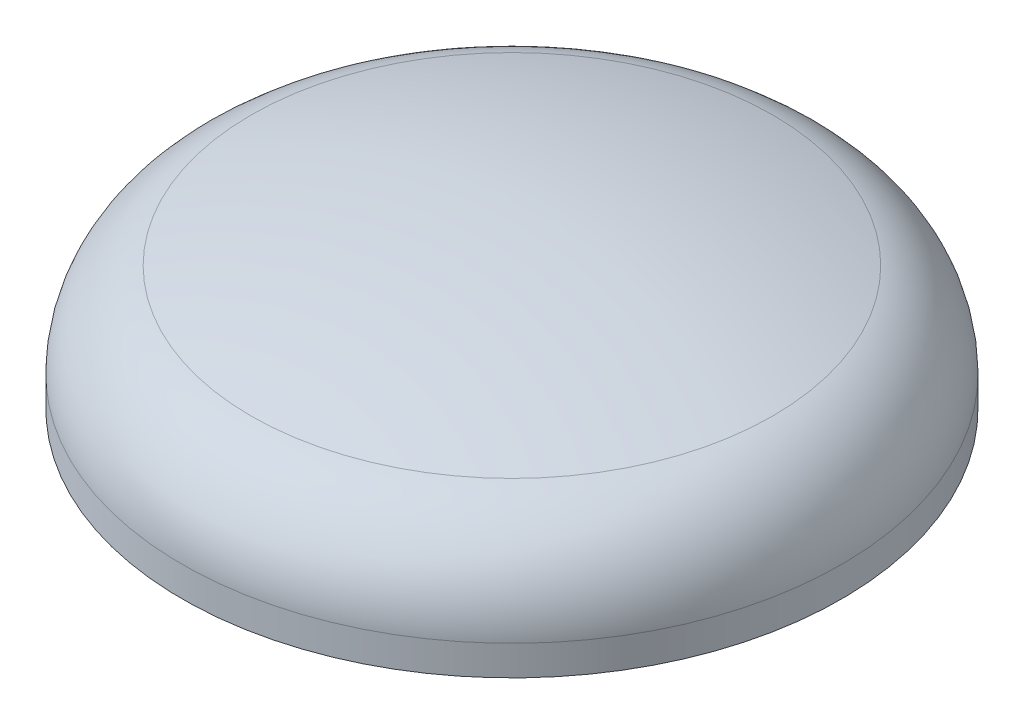
ISO-10303-21;
HEADER;
FILE_DESCRIPTION(('STEP AP214'),'2;1');
FILE_NAME('part.step','',(''),(''),'','','');
FILE_SCHEMA(('AUTOMOTIVE_DESIGN { 1 0 10303 214 1 1 1 1 }'));
ENDSEC;
DATA;
#1=APPLICATION_CONTEXT('core data for automotive mechanical design processes');
#2=APPLICATION_PROTOCOL_DEFINITION('international standard','automotive_design',2000,#1);
#3=PRODUCT_CONTEXT('',#1,'mechanical');
#4=PRODUCT('Part','Part','',(#3));
#5=PRODUCT_RELATED_PRODUCT_CATEGORY('part','',(#4));
#6=PRODUCT_DEFINITION_FORMATION('','',#4);
#7=PRODUCT_DEFINITION_CONTEXT('part definition',#1,'design');
#8=PRODUCT_DEFINITION('design','',#6,#7);
#9=PRODUCT_DEFINITION_SHAPE('','',#8);
#10=(LENGTH_UNIT() NAMED_UNIT(*) SI_UNIT(.MILLI.,.METRE.));
#11=(NAMED_UNIT(*) PLANE_ANGLE_UNIT() SI_UNIT($,.RADIAN.));
#12=(NAMED_UNIT(*) SI_UNIT($,.STERADIAN.) SOLID_ANGLE_UNIT());
#13=UNCERTAINTY_MEASURE_WITH_UNIT(LENGTH_MEASURE(1.E-05),#10,'distance_accuracy_value','');
#14=(GEOMETRIC_REPRESENTATION_CONTEXT(3) GLOBAL_UNCERTAINTY_ASSIGNED_CONTEXT((#13)) GLOBAL_UNIT_ASSIGNED_CONTEXT((#10,
#11,#12)) REPRESENTATION_CONTEXT('',''));
#15=CARTESIAN_POINT('',(0.,0.,0.));
#16=DIRECTION('',(0.,0.,1.));
#17=DIRECTION('',(1.,0.,0.));
#18=AXIS2_PLACEMENT_3D('',#15,#16,#17);
#19=CARTESIAN_POINT('',(0.,0.,0.));
#20=DIRECTION('',(0.,-1.,0.));
#21=DIRECTION('',(0.,0.,-1.));
#22=AXIS2_PLACEMENT_3D('',#19,#20,#21);
#23=PLANE('',#22);
#24=CARTESIAN_POINT('',(0.,0.,0.));
#25=DIRECTION('',(0.,-1.,0.));
#26=DIRECTION('',(0.,0.,-1.));
#27=AXIS2_PLACEMENT_3D('',#24,#25,#26);
#28=CIRCLE('',#27,0.5);
#29=CARTESIAN_POINT('',(0.,0.,-0.5));
#30=VERTEX_POINT('',#29);
#31=EDGE_CURVE('E10',#30,#30,#28,.T.);
#32=ORIENTED_EDGE('',*,*,#31,.T.);
#33=EDGE_LOOP('',(#32));
#34=FACE_BOUND('',#33,.T.);
#35=ADVANCED_FACE('F32',(#34),#23,.T.);
#36=CARTESIAN_POINT('',(0.,0.,0.));
#37=DIRECTION('',(0.,-1.,0.));
#38=DIRECTION('',(0.,0.,-1.));
#39=AXIS2_PLACEMENT_3D('',#36,#37,#38);
#40=CYLINDRICAL_SURFACE('',#39,0.5);
#41=CARTESIAN_POINT('',(0.,0.0454451150103323,0.));
#42=DIRECTION('',(0.,-1.,0.));
#43=DIRECTION('',(0.,0.,-1.));
#44=AXIS2_PLACEMENT_3D('',#41,#42,#43);
#45=CIRCLE('',#44,0.5);
#46=CARTESIAN_POINT('',(0.,0.0454451150103323,-0.5));
#47=VERTEX_POINT('',#46);
#48=EDGE_CURVE('E38',#47,#47,#45,.T.);
#49=ORIENTED_EDGE('',*,*,#48,.T.);
#50=EDGE_LOOP('',(#49));
#51=FACE_BOUND('',#50,.T.);
#52=ORIENTED_EDGE('',*,*,#31,.F.);
#53=EDGE_LOOP('',(#52));
#54=FACE_BOUND('',#53,.T.);
#55=ADVANCED_FACE('F58',(#51,#54),#40,.T.);
#56=CARTESIAN_POINT('',(0.,0.0454451150103319,0.));
#57=DIRECTION('',(0.,-1.,0.));
#58=DIRECTION('',(0.,0.,-1.));
#59=AXIS2_PLACEMENT_3D('',#56,#57,#58);
#60=TOROIDAL_SURFACE('',#59,0.35,0.15);
#61=CARTESIAN_POINT('',(0.,0.188329260446463,0.));
#62=DIRECTION('',(0.,-1.,0.));
#63=DIRECTION('',(0.,0.,-1.));
#64=AXIS2_PLACEMENT_3D('',#61,#62,#63);
#65=CIRCLE('',#64,0.395652173913044);
#66=CARTESIAN_POINT('',(0.,0.188329260446463,-0.395652173913044));
#67=VERTEX_POINT('',#66);
#68=EDGE_CURVE('E42',#67,#67,#65,.T.);
#69=ORIENTED_EDGE('',*,*,#68,.T.);
#70=EDGE_LOOP('',(#69));
#71=FACE_BOUND('',#70,.T.);
#72=ORIENTED_EDGE('',*,*,#48,.F.);
#73=EDGE_LOOP('',(#72));
#74=FACE_BOUND('',#73,.T.);
#75=ADVANCED_FACE('F49',(#71,#74),#60,.T.);
#76=CARTESIAN_POINT('',(0.,-1.05000000000001,0.));
#77=DIRECTION('',(0.,-1.,0.));
#78=DIRECTION('',(0.,0.,-1.));
#79=AXIS2_PLACEMENT_3D('',#76,#77,#78);
#80=SPHERICAL_SURFACE('',#79,1.30000000000001);
#81=ORIENTED_EDGE('',*,*,#68,.F.);
#82=EDGE_LOOP('',(#81));
#83=FACE_BOUND('',#82,.T.);
#84=ADVANCED_FACE('F52',(#83),#80,.T.);
#85=CLOSED_SHELL('',(#35,#55,#75,#84));
#86=MANIFOLD_SOLID_BREP('B2',#85);
#87=ADVANCED_BREP_SHAPE_REPRESENTATION('',(#18,#86),#14);
#88=SHAPE_DEFINITION_REPRESENTATION(#9,#87);
ENDSEC;
END-ISO-10303-21;
